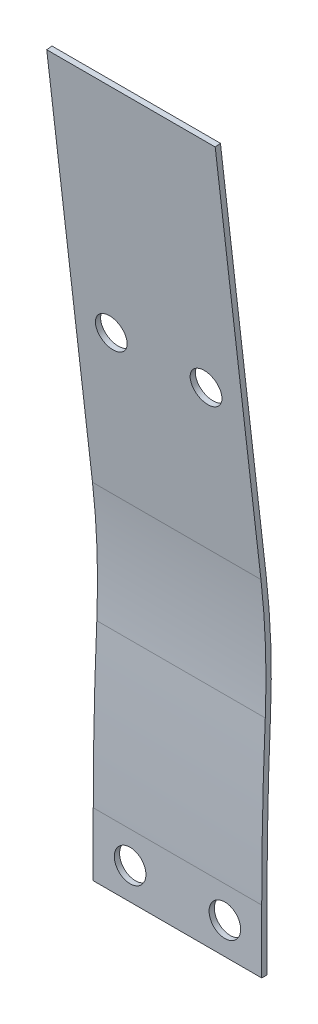
ISO-10303-21;
HEADER;
FILE_DESCRIPTION(('STEP AP214'),'2;1');
FILE_NAME('part.step','',(''),(''),'','','');
FILE_SCHEMA(('AUTOMOTIVE_DESIGN { 1 0 10303 214 1 1 1 1 }'));
ENDSEC;
DATA;
#1=APPLICATION_CONTEXT('core data for automotive mechanical design processes');
#2=APPLICATION_PROTOCOL_DEFINITION('international standard','automotive_design',2000,#1);
#3=PRODUCT_CONTEXT('',#1,'mechanical');
#4=PRODUCT('Part','Part','',(#3));
#5=PRODUCT_RELATED_PRODUCT_CATEGORY('part','',(#4));
#6=PRODUCT_DEFINITION_FORMATION('','',#4);
#7=PRODUCT_DEFINITION_CONTEXT('part definition',#1,'design');
#8=PRODUCT_DEFINITION('design','',#6,#7);
#9=PRODUCT_DEFINITION_SHAPE('','',#8);
#10=(LENGTH_UNIT() NAMED_UNIT(*) SI_UNIT(.MILLI.,.METRE.));
#11=(NAMED_UNIT(*) PLANE_ANGLE_UNIT() SI_UNIT($,.RADIAN.));
#12=(NAMED_UNIT(*) SI_UNIT($,.STERADIAN.) SOLID_ANGLE_UNIT());
#13=UNCERTAINTY_MEASURE_WITH_UNIT(LENGTH_MEASURE(1.E-05),#10,'distance_accuracy_value','');
#14=(GEOMETRIC_REPRESENTATION_CONTEXT(3) GLOBAL_UNCERTAINTY_ASSIGNED_CONTEXT((#13)) GLOBAL_UNIT_ASSIGNED_CONTEXT((#10,
#11,#12)) REPRESENTATION_CONTEXT('',''));
#15=CARTESIAN_POINT('',(0.,0.,0.));
#16=DIRECTION('',(0.,0.,1.));
#17=DIRECTION('',(1.,0.,0.));
#18=AXIS2_PLACEMENT_3D('',#15,#16,#17);
#19=CARTESIAN_POINT('',(0.,0.,0.5));
#20=DIRECTION('',(0.,0.,1.));
#21=DIRECTION('',(1.,0.,0.));
#22=AXIS2_PLACEMENT_3D('',#19,#20,#21);
#23=PLANE('',#22);
#24=CARTESIAN_POINT('',(-4.5,0.,0.5));
#25=DIRECTION('',(0.,0.,1.));
#26=DIRECTION('',(1.,0.,0.));
#27=AXIS2_PLACEMENT_3D('',#24,#25,#26);
#28=CIRCLE('',#27,1.5);
#29=CARTESIAN_POINT('',(-3.,0.,0.5));
#30=VERTEX_POINT('',#29);
#31=EDGE_CURVE('E207',#30,#30,#28,.T.);
#32=ORIENTED_EDGE('',*,*,#31,.F.);
#33=EDGE_LOOP('',(#32));
#34=FACE_BOUND('',#33,.T.);
#35=DIRECTION('',(0.,-1.,0.));
#36=VECTOR('',#35,1.);
#37=CARTESIAN_POINT('',(-8.,3.,0.5));
#38=LINE('',#37,#36);
#39=CARTESIAN_POINT('',(-8.,3.,0.5));
#40=VERTEX_POINT('',#39);
#41=CARTESIAN_POINT('',(-8.,-3.,0.5));
#42=VERTEX_POINT('',#41);
#43=EDGE_CURVE('E212',#40,#42,#38,.T.);
#44=ORIENTED_EDGE('',*,*,#43,.T.);
#45=DIRECTION('',(1.,0.,0.));
#46=VECTOR('',#45,1.);
#47=CARTESIAN_POINT('',(-8.,-3.,0.5));
#48=LINE('',#47,#46);
#49=CARTESIAN_POINT('',(8.,-3.,0.5));
#50=VERTEX_POINT('',#49);
#51=EDGE_CURVE('E84',#42,#50,#48,.T.);
#52=ORIENTED_EDGE('',*,*,#51,.T.);
#53=DIRECTION('',(0.,1.,0.));
#54=VECTOR('',#53,1.);
#55=CARTESIAN_POINT('',(8.,3.,0.5));
#56=LINE('',#55,#54);
#57=CARTESIAN_POINT('',(8.,3.,0.5));
#58=VERTEX_POINT('',#57);
#59=EDGE_CURVE('E216',#50,#58,#56,.T.);
#60=ORIENTED_EDGE('',*,*,#59,.T.);
#61=DIRECTION('',(-1.,0.,0.));
#62=VECTOR('',#61,1.);
#63=CARTESIAN_POINT('',(-8.,3.,0.5));
#64=LINE('',#63,#62);
#65=EDGE_CURVE('E59',#58,#40,#64,.T.);
#66=ORIENTED_EDGE('',*,*,#65,.T.);
#67=EDGE_LOOP('',(#44,#52,#60,#66));
#68=FACE_BOUND('',#67,.T.);
#69=CARTESIAN_POINT('',(4.5,0.,0.5));
#70=DIRECTION('',(0.,0.,1.));
#71=DIRECTION('',(1.,0.,0.));
#72=AXIS2_PLACEMENT_3D('',#69,#70,#71);
#73=CIRCLE('',#72,1.5);
#74=CARTESIAN_POINT('',(6.,0.,0.5));
#75=VERTEX_POINT('',#74);
#76=EDGE_CURVE('E201',#75,#75,#73,.T.);
#77=ORIENTED_EDGE('',*,*,#76,.F.);
#78=EDGE_LOOP('',(#77));
#79=FACE_BOUND('',#78,.T.);
#80=ADVANCED_FACE('F42',(#34,#68,#79),#23,.T.);
#81=CARTESIAN_POINT('',(0.,0.,0.));
#82=DIRECTION('',(0.,0.,1.));
#83=DIRECTION('',(1.,0.,0.));
#84=AXIS2_PLACEMENT_3D('',#81,#82,#83);
#85=PLANE('',#84);
#86=DIRECTION('',(0.,-1.,0.));
#87=VECTOR('',#86,1.);
#88=CARTESIAN_POINT('',(-8.,3.,0.));
#89=LINE('',#88,#87);
#90=CARTESIAN_POINT('',(-8.,3.,0.));
#91=VERTEX_POINT('',#90);
#92=CARTESIAN_POINT('',(-8.,-3.,0.));
#93=VERTEX_POINT('',#92);
#94=EDGE_CURVE('E79',#91,#93,#89,.T.);
#95=ORIENTED_EDGE('',*,*,#94,.F.);
#96=DIRECTION('',(-1.,0.,0.));
#97=VECTOR('',#96,1.);
#98=CARTESIAN_POINT('',(-8.,3.,0.));
#99=LINE('',#98,#97);
#100=CARTESIAN_POINT('',(8.,3.,0.));
#101=VERTEX_POINT('',#100);
#102=EDGE_CURVE('E214',#101,#91,#99,.T.);
#103=ORIENTED_EDGE('',*,*,#102,.F.);
#104=DIRECTION('',(0.,1.,0.));
#105=VECTOR('',#104,1.);
#106=CARTESIAN_POINT('',(8.,3.,0.));
#107=LINE('',#106,#105);
#108=CARTESIAN_POINT('',(8.,-3.,0.));
#109=VERTEX_POINT('',#108);
#110=EDGE_CURVE('E221',#109,#101,#107,.T.);
#111=ORIENTED_EDGE('',*,*,#110,.F.);
#112=DIRECTION('',(1.,0.,0.));
#113=VECTOR('',#112,1.);
#114=CARTESIAN_POINT('',(-8.,-3.,0.));
#115=LINE('',#114,#113);
#116=EDGE_CURVE('E72',#93,#109,#115,.T.);
#117=ORIENTED_EDGE('',*,*,#116,.F.);
#118=EDGE_LOOP('',(#95,#103,#111,#117));
#119=FACE_BOUND('',#118,.T.);
#120=CARTESIAN_POINT('',(-4.5,0.,0.));
#121=DIRECTION('',(0.,0.,1.));
#122=DIRECTION('',(1.,0.,0.));
#123=AXIS2_PLACEMENT_3D('',#120,#121,#122);
#124=CIRCLE('',#123,1.5);
#125=CARTESIAN_POINT('',(-3.,0.,0.));
#126=VERTEX_POINT('',#125);
#127=EDGE_CURVE('E204',#126,#126,#124,.T.);
#128=ORIENTED_EDGE('',*,*,#127,.T.);
#129=EDGE_LOOP('',(#128));
#130=FACE_BOUND('',#129,.T.);
#131=CARTESIAN_POINT('',(4.5,0.,0.));
#132=DIRECTION('',(0.,0.,1.));
#133=DIRECTION('',(1.,0.,0.));
#134=AXIS2_PLACEMENT_3D('',#131,#132,#133);
#135=CIRCLE('',#134,1.5);
#136=CARTESIAN_POINT('',(6.,0.,0.));
#137=VERTEX_POINT('',#136);
#138=EDGE_CURVE('E176',#137,#137,#135,.T.);
#139=ORIENTED_EDGE('',*,*,#138,.T.);
#140=EDGE_LOOP('',(#139));
#141=FACE_BOUND('',#140,.T.);
#142=ADVANCED_FACE('F227',(#119,#130,#141),#85,.F.);
#143=CARTESIAN_POINT('',(-8.,3.,0.5));
#144=DIRECTION('',(1.,0.,0.));
#145=DIRECTION('',(0.,0.,-1.));
#146=AXIS2_PLACEMENT_3D('',#143,#144,#145);
#147=PLANE('',#146);
#148=ORIENTED_EDGE('',*,*,#94,.T.);
#149=DIRECTION('',(0.,0.,-1.));
#150=VECTOR('',#149,1.);
#151=CARTESIAN_POINT('',(-8.,-3.,0.5));
#152=LINE('',#151,#150);
#153=EDGE_CURVE('E11',#42,#93,#152,.T.);
#154=ORIENTED_EDGE('',*,*,#153,.F.);
#155=ORIENTED_EDGE('',*,*,#43,.F.);
#156=CARTESIAN_POINT('',(-8.,3.,-344.390167475055));
#157=DIRECTION('',(-1.,0.,0.));
#158=DIRECTION('',(0.,0.,1.));
#159=AXIS2_PLACEMENT_3D('',#156,#157,#158);
#160=CIRCLE('',#159,344.890167475055);
#161=CARTESIAN_POINT('',(-8.,18.2202314265775,0.163996882732109));
#162=VERTEX_POINT('',#161);
#163=EDGE_CURVE('E167',#162,#40,#160,.F.);
#164=ORIENTED_EDGE('',*,*,#163,.F.);
#165=CARTESIAN_POINT('',(-8.,21.4467131980166,73.2047870925716));
#166=DIRECTION('',(-1.,0.,0.));
#167=DIRECTION('',(0.,0.,1.));
#168=AXIS2_PLACEMENT_3D('',#165,#166,#167);
#169=CIRCLE('',#168,73.1120182945268);
#170=CARTESIAN_POINT('',(-8.,29.8072386789439,0.572364354637419));
#171=VERTEX_POINT('',#170);
#172=EDGE_CURVE('E179',#171,#162,#169,.T.);
#173=ORIENTED_EDGE('',*,*,#172,.F.);
#174=DIRECTION('',(0.,0.993440263751706,0.11435227307291));
#175=VECTOR('',#174,1.);
#176=CARTESIAN_POINT('',(-8.,0.324750815805507,-2.82128660356148));
#177=LINE('',#176,#175);
#178=CARTESIAN_POINT('',(-8.,67.5579687015087,4.91775073140799));
#179=VERTEX_POINT('',#178);
#180=EDGE_CURVE('E182',#171,#179,#177,.T.);
#181=ORIENTED_EDGE('',*,*,#180,.T.);
#182=DIRECTION('',(0.,0.11435227307291,-0.993440263751706));
#183=VECTOR('',#182,1.);
#184=CARTESIAN_POINT('',(-8.,65.5123730537276,22.6889504220811));
#185=LINE('',#184,#183);
#186=CARTESIAN_POINT('',(-8.,67.6151448380452,4.42103059953213));
#187=VERTEX_POINT('',#186);
#188=EDGE_CURVE('E151',#179,#187,#185,.T.);
#189=ORIENTED_EDGE('',*,*,#188,.T.);
#190=DIRECTION('',(0.,0.993440263751706,0.11435227307291));
#191=VECTOR('',#190,1.);
#192=CARTESIAN_POINT('',(-8.,0.381926952341963,-3.31800673543734));
#193=LINE('',#192,#191);
#194=CARTESIAN_POINT('',(-8.,29.8644148154804,0.0756442227615658));
#195=VERTEX_POINT('',#194);
#196=EDGE_CURVE('E149',#195,#187,#193,.T.);
#197=ORIENTED_EDGE('',*,*,#196,.F.);
#198=CARTESIAN_POINT('',(-8.,21.4467131980166,73.2047870925716));
#199=DIRECTION('',(-1.,0.,0.));
#200=DIRECTION('',(0.,0.,1.));
#201=AXIS2_PLACEMENT_3D('',#198,#199,#200);
#202=CIRCLE('',#201,73.6120182945268);
#203=CARTESIAN_POINT('',(-8.,18.1981660955505,-0.335516001152447));
#204=VERTEX_POINT('',#203);
#205=EDGE_CURVE('E185',#195,#204,#202,.T.);
#206=ORIENTED_EDGE('',*,*,#205,.T.);
#207=CARTESIAN_POINT('',(-8.,3.,-344.390167475055));
#208=DIRECTION('',(-1.,0.,0.));
#209=DIRECTION('',(0.,0.,1.));
#210=AXIS2_PLACEMENT_3D('',#207,#208,#209);
#211=CIRCLE('',#210,344.390167475055);
#212=EDGE_CURVE('E188',#204,#91,#211,.F.);
#213=ORIENTED_EDGE('',*,*,#212,.T.);
#214=EDGE_LOOP('',(#148,#154,#155,#164,#173,#181,#189,#197,#206,#213));
#215=FACE_BOUND('',#214,.T.);
#216=ADVANCED_FACE('F44',(#215),#147,.F.);
#217=CARTESIAN_POINT('',(-8.,-3.,0.5));
#218=DIRECTION('',(0.,1.,0.));
#219=DIRECTION('',(-1.,0.,0.));
#220=AXIS2_PLACEMENT_3D('',#217,#218,#219);
#221=PLANE('',#220);
#222=ORIENTED_EDGE('',*,*,#116,.T.);
#223=DIRECTION('',(0.,0.,-1.));
#224=VECTOR('',#223,1.);
#225=CARTESIAN_POINT('',(8.,-3.,0.5));
#226=LINE('',#225,#224);
#227=EDGE_CURVE('E51',#50,#109,#226,.T.);
#228=ORIENTED_EDGE('',*,*,#227,.F.);
#229=ORIENTED_EDGE('',*,*,#51,.F.);
#230=ORIENTED_EDGE('',*,*,#153,.T.);
#231=EDGE_LOOP('',(#222,#228,#229,#230));
#232=FACE_BOUND('',#231,.T.);
#233=ADVANCED_FACE('F262',(#232),#221,.F.);
#234=CARTESIAN_POINT('',(8.,3.,0.5));
#235=DIRECTION('',(-1.,0.,0.));
#236=DIRECTION('',(0.,0.,1.));
#237=AXIS2_PLACEMENT_3D('',#234,#235,#236);
#238=PLANE('',#237);
#239=ORIENTED_EDGE('',*,*,#110,.T.);
#240=CARTESIAN_POINT('',(8.,3.,-344.390167475055));
#241=DIRECTION('',(-1.,0.,0.));
#242=DIRECTION('',(0.,0.,1.));
#243=AXIS2_PLACEMENT_3D('',#240,#241,#242);
#244=CIRCLE('',#243,344.390167475055);
#245=CARTESIAN_POINT('',(8.,18.1981660955505,-0.335516001152447));
#246=VERTEX_POINT('',#245);
#247=EDGE_CURVE('E171',#101,#246,#244,.T.);
#248=ORIENTED_EDGE('',*,*,#247,.T.);
#249=CARTESIAN_POINT('',(8.,21.4467131980166,73.2047870925716));
#250=DIRECTION('',(-1.,0.,0.));
#251=DIRECTION('',(0.,0.,1.));
#252=AXIS2_PLACEMENT_3D('',#249,#250,#251);
#253=CIRCLE('',#252,73.6120182945268);
#254=CARTESIAN_POINT('',(8.,29.8644148154803,0.0756442227615615));
#255=VERTEX_POINT('',#254);
#256=EDGE_CURVE('E132',#246,#255,#253,.F.);
#257=ORIENTED_EDGE('',*,*,#256,.T.);
#258=DIRECTION('',(0.,-0.993440263751706,-0.11435227307291));
#259=VECTOR('',#258,1.);
#260=CARTESIAN_POINT('',(8.,0.381926952341963,-3.31800673543734));
#261=LINE('',#260,#259);
#262=CARTESIAN_POINT('',(8.,67.6151448380452,4.42103059953213));
#263=VERTEX_POINT('',#262);
#264=EDGE_CURVE('E125',#263,#255,#261,.T.);
#265=ORIENTED_EDGE('',*,*,#264,.F.);
#266=DIRECTION('',(0.,0.11435227307291,-0.993440263751706));
#267=VECTOR('',#266,1.);
#268=CARTESIAN_POINT('',(8.,65.5123730537276,22.6889504220811));
#269=LINE('',#268,#267);
#270=CARTESIAN_POINT('',(8.,67.5579687015087,4.91775073140799));
#271=VERTEX_POINT('',#270);
#272=EDGE_CURVE('E129',#271,#263,#269,.T.);
#273=ORIENTED_EDGE('',*,*,#272,.F.);
#274=DIRECTION('',(0.,-0.993440263751706,-0.11435227307291));
#275=VECTOR('',#274,1.);
#276=CARTESIAN_POINT('',(8.,0.324750815805507,-2.82128660356148));
#277=LINE('',#276,#275);
#278=CARTESIAN_POINT('',(8.,29.8072386789439,0.572364354637419));
#279=VERTEX_POINT('',#278);
#280=EDGE_CURVE('E136',#271,#279,#277,.T.);
#281=ORIENTED_EDGE('',*,*,#280,.T.);
#282=CARTESIAN_POINT('',(8.,21.4467131980166,73.2047870925716));
#283=DIRECTION('',(-1.,0.,0.));
#284=DIRECTION('',(0.,0.,1.));
#285=AXIS2_PLACEMENT_3D('',#282,#283,#284);
#286=CIRCLE('',#285,73.1120182945268);
#287=CARTESIAN_POINT('',(8.,18.2202314265775,0.163996882732109));
#288=VERTEX_POINT('',#287);
#289=EDGE_CURVE('E168',#288,#279,#286,.F.);
#290=ORIENTED_EDGE('',*,*,#289,.F.);
#291=CARTESIAN_POINT('',(8.,3.,-344.390167475055));
#292=DIRECTION('',(-1.,0.,0.));
#293=DIRECTION('',(0.,0.,1.));
#294=AXIS2_PLACEMENT_3D('',#291,#292,#293);
#295=CIRCLE('',#294,344.890167475055);
#296=EDGE_CURVE('E173',#58,#288,#295,.T.);
#297=ORIENTED_EDGE('',*,*,#296,.F.);
#298=ORIENTED_EDGE('',*,*,#59,.F.);
#299=ORIENTED_EDGE('',*,*,#227,.T.);
#300=EDGE_LOOP('',(#239,#248,#257,#265,#273,#281,#290,#297,#298,#299));
#301=FACE_BOUND('',#300,.T.);
#302=ADVANCED_FACE('F128',(#301),#238,.F.);
#303=CARTESIAN_POINT('',(-4.5,0.,0.5));
#304=DIRECTION('',(0.,0.,-1.));
#305=DIRECTION('',(-1.,0.,0.));
#306=AXIS2_PLACEMENT_3D('',#303,#304,#305);
#307=CYLINDRICAL_SURFACE('',#306,1.5);
#308=ORIENTED_EDGE('',*,*,#31,.T.);
#309=EDGE_LOOP('',(#308));
#310=FACE_BOUND('',#309,.T.);
#311=ORIENTED_EDGE('',*,*,#127,.F.);
#312=EDGE_LOOP('',(#311));
#313=FACE_BOUND('',#312,.T.);
#314=ADVANCED_FACE('F258',(#310,#313),#307,.F.);
#315=CARTESIAN_POINT('',(4.5,0.,0.5));
#316=DIRECTION('',(0.,0.,-1.));
#317=DIRECTION('',(-1.,0.,0.));
#318=AXIS2_PLACEMENT_3D('',#315,#316,#317);
#319=CYLINDRICAL_SURFACE('',#318,1.5);
#320=ORIENTED_EDGE('',*,*,#76,.T.);
#321=EDGE_LOOP('',(#320));
#322=FACE_BOUND('',#321,.T.);
#323=ORIENTED_EDGE('',*,*,#138,.F.);
#324=EDGE_LOOP('',(#323));
#325=FACE_BOUND('',#324,.T.);
#326=ADVANCED_FACE('F289',(#322,#325),#319,.F.);
#327=CARTESIAN_POINT('',(64.8389743920276,21.4467131980166,73.2047870925716));
#328=DIRECTION('',(-1.,0.,0.));
#329=DIRECTION('',(0.,0.,1.));
#330=AXIS2_PLACEMENT_3D('',#327,#328,#329);
#331=CYLINDRICAL_SURFACE('',#330,73.1120182945268);
#332=DIRECTION('',(-1.,0.,0.));
#333=VECTOR('',#332,1.);
#334=CARTESIAN_POINT('',(64.8389743920276,18.2202314265775,0.163996882732109));
#335=LINE('',#334,#333);
#336=EDGE_CURVE('E191',#288,#162,#335,.T.);
#337=ORIENTED_EDGE('',*,*,#336,.F.);
#338=ORIENTED_EDGE('',*,*,#289,.T.);
#339=DIRECTION('',(-1.,0.,0.));
#340=VECTOR('',#339,1.);
#341=CARTESIAN_POINT('',(64.8389743920276,29.8072386789439,0.572364354637419));
#342=LINE('',#341,#340);
#343=EDGE_CURVE('E196',#279,#171,#342,.T.);
#344=ORIENTED_EDGE('',*,*,#343,.T.);
#345=ORIENTED_EDGE('',*,*,#172,.T.);
#346=EDGE_LOOP('',(#337,#338,#344,#345));
#347=FACE_BOUND('',#346,.T.);
#348=ADVANCED_FACE('F285',(#347),#331,.F.);
#349=CARTESIAN_POINT('',(64.8389743920276,0.324750815805507,-2.82128660356148));
#350=DIRECTION('',(0.,-0.11435227307291,0.993440263751706));
#351=DIRECTION('',(0.,-0.993440263751706,-0.11435227307291));
#352=AXIS2_PLACEMENT_3D('',#349,#350,#351);
#353=PLANE('',#352);
#354=CARTESIAN_POINT('',(4.5,44.7088426352195,2.28764845073107));
#355=DIRECTION('',(0.,-0.11435227307291,0.993440263751706));
#356=DIRECTION('',(0.,-0.993440263751706,-0.11435227307291));
#357=AXIS2_PLACEMENT_3D('',#354,#355,#356);
#358=CIRCLE('',#357,1.5);
#359=CARTESIAN_POINT('',(4.5,43.2186822395919,2.1161200411217));
#360=VERTEX_POINT('',#359);
#361=EDGE_CURVE('E164',#360,#360,#358,.T.);
#362=ORIENTED_EDGE('',*,*,#361,.F.);
#363=EDGE_LOOP('',(#362));
#364=FACE_BOUND('',#363,.T.);
#365=CARTESIAN_POINT('',(-4.5,44.7088426352195,2.28764845073107));
#366=DIRECTION('',(0.,-0.11435227307291,0.993440263751706));
#367=DIRECTION('',(0.,-0.993440263751706,-0.11435227307291));
#368=AXIS2_PLACEMENT_3D('',#365,#366,#367);
#369=CIRCLE('',#368,1.5);
#370=CARTESIAN_POINT('',(-4.5,43.2186822395919,2.1161200411217));
#371=VERTEX_POINT('',#370);
#372=EDGE_CURVE('E159',#371,#371,#369,.T.);
#373=ORIENTED_EDGE('',*,*,#372,.F.);
#374=EDGE_LOOP('',(#373));
#375=FACE_BOUND('',#374,.T.);
#376=ORIENTED_EDGE('',*,*,#280,.F.);
#377=DIRECTION('',(1.,0.,0.));
#378=VECTOR('',#377,1.);
#379=CARTESIAN_POINT('',(8.,67.5579687015087,4.91775073140799));
#380=LINE('',#379,#378);
#381=EDGE_CURVE('E144',#179,#271,#380,.T.);
#382=ORIENTED_EDGE('',*,*,#381,.F.);
#383=ORIENTED_EDGE('',*,*,#180,.F.);
#384=ORIENTED_EDGE('',*,*,#343,.F.);
#385=EDGE_LOOP('',(#376,#382,#383,#384));
#386=FACE_BOUND('',#385,.T.);
#387=ADVANCED_FACE('F246',(#364,#375,#386),#353,.T.);
#388=CARTESIAN_POINT('',(64.8389743920276,0.381926952341963,-3.31800673543734));
#389=DIRECTION('',(0.,-0.11435227307291,0.993440263751706));
#390=DIRECTION('',(0.,-0.993440263751706,-0.11435227307291));
#391=AXIS2_PLACEMENT_3D('',#388,#389,#390);
#392=PLANE('',#391);
#393=CARTESIAN_POINT('',(4.5,44.7660187717559,1.79092831885521));
#394=DIRECTION('',(0.,0.11435227307291,-0.993440263751706));
#395=DIRECTION('',(0.,0.993440263751706,0.11435227307291));
#396=AXIS2_PLACEMENT_3D('',#393,#394,#395);
#397=CIRCLE('',#396,1.5);
#398=CARTESIAN_POINT('',(4.5,46.2561791673835,1.96245672846457));
#399=VERTEX_POINT('',#398);
#400=EDGE_CURVE('E156',#399,#399,#397,.T.);
#401=ORIENTED_EDGE('',*,*,#400,.F.);
#402=EDGE_LOOP('',(#401));
#403=FACE_BOUND('',#402,.T.);
#404=CARTESIAN_POINT('',(-4.5,44.7660187717559,1.79092831885521));
#405=DIRECTION('',(0.,0.11435227307291,-0.993440263751706));
#406=DIRECTION('',(0.,0.993440263751706,0.11435227307291));
#407=AXIS2_PLACEMENT_3D('',#404,#405,#406);
#408=CIRCLE('',#407,1.5);
#409=CARTESIAN_POINT('',(-4.5,46.2561791673835,1.96245672846457));
#410=VERTEX_POINT('',#409);
#411=EDGE_CURVE('E145',#410,#410,#408,.T.);
#412=ORIENTED_EDGE('',*,*,#411,.F.);
#413=EDGE_LOOP('',(#412));
#414=FACE_BOUND('',#413,.T.);
#415=ORIENTED_EDGE('',*,*,#196,.T.);
#416=DIRECTION('',(1.,0.,0.));
#417=VECTOR('',#416,1.);
#418=CARTESIAN_POINT('',(8.,67.6151448380452,4.42103059953213));
#419=LINE('',#418,#417);
#420=EDGE_CURVE('E142',#187,#263,#419,.T.);
#421=ORIENTED_EDGE('',*,*,#420,.T.);
#422=ORIENTED_EDGE('',*,*,#264,.T.);
#423=DIRECTION('',(-1.,0.,0.));
#424=VECTOR('',#423,1.);
#425=CARTESIAN_POINT('',(64.8389743920276,29.8644148154804,0.0756442227615658));
#426=LINE('',#425,#424);
#427=EDGE_CURVE('E194',#255,#195,#426,.T.);
#428=ORIENTED_EDGE('',*,*,#427,.T.);
#429=EDGE_LOOP('',(#415,#421,#422,#428));
#430=FACE_BOUND('',#429,.T.);
#431=ADVANCED_FACE('F147',(#403,#414,#430),#392,.F.);
#432=CARTESIAN_POINT('',(64.8389743920276,21.4467131980166,73.2047870925716));
#433=DIRECTION('',(-1.,0.,0.));
#434=DIRECTION('',(0.,0.,1.));
#435=AXIS2_PLACEMENT_3D('',#432,#433,#434);
#436=CYLINDRICAL_SURFACE('',#435,73.6120182945268);
#437=ORIENTED_EDGE('',*,*,#256,.F.);
#438=DIRECTION('',(-1.,0.,0.));
#439=VECTOR('',#438,1.);
#440=CARTESIAN_POINT('',(64.8389743920276,18.1981660955505,-0.335516001152447));
#441=LINE('',#440,#439);
#442=EDGE_CURVE('E192',#246,#204,#441,.T.);
#443=ORIENTED_EDGE('',*,*,#442,.T.);
#444=ORIENTED_EDGE('',*,*,#205,.F.);
#445=ORIENTED_EDGE('',*,*,#427,.F.);
#446=EDGE_LOOP('',(#437,#443,#444,#445));
#447=FACE_BOUND('',#446,.T.);
#448=ADVANCED_FACE('F237',(#447),#436,.T.);
#449=CARTESIAN_POINT('',(64.8389743920276,3.,-344.390167475055));
#450=DIRECTION('',(-1.,0.,0.));
#451=DIRECTION('',(0.,0.,1.));
#452=AXIS2_PLACEMENT_3D('',#449,#450,#451);
#453=CYLINDRICAL_SURFACE('',#452,344.390167475055);
#454=ORIENTED_EDGE('',*,*,#247,.F.);
#455=ORIENTED_EDGE('',*,*,#102,.T.);
#456=ORIENTED_EDGE('',*,*,#212,.F.);
#457=ORIENTED_EDGE('',*,*,#442,.F.);
#458=EDGE_LOOP('',(#454,#455,#456,#457));
#459=FACE_BOUND('',#458,.T.);
#460=ADVANCED_FACE('F231',(#459),#453,.F.);
#461=CARTESIAN_POINT('',(64.8389743920276,3.,-344.390167475055));
#462=DIRECTION('',(-1.,0.,0.));
#463=DIRECTION('',(0.,0.,1.));
#464=AXIS2_PLACEMENT_3D('',#461,#462,#463);
#465=CYLINDRICAL_SURFACE('',#464,344.890167475055);
#466=ORIENTED_EDGE('',*,*,#65,.F.);
#467=ORIENTED_EDGE('',*,*,#296,.T.);
#468=ORIENTED_EDGE('',*,*,#336,.T.);
#469=ORIENTED_EDGE('',*,*,#163,.T.);
#470=EDGE_LOOP('',(#466,#467,#468,#469));
#471=FACE_BOUND('',#470,.T.);
#472=ADVANCED_FACE('F244',(#471),#465,.T.);
#473=CARTESIAN_POINT('',(-4.5,43.8901207394235,9.40032994137646));
#474=DIRECTION('',(0.,0.11435227307291,-0.993440263751706));
#475=DIRECTION('',(0.,0.993440263751706,0.11435227307291));
#476=AXIS2_PLACEMENT_3D('',#473,#474,#475);
#477=CYLINDRICAL_SURFACE('',#476,1.5);
#478=ORIENTED_EDGE('',*,*,#372,.T.);
#479=EDGE_LOOP('',(#478));
#480=FACE_BOUND('',#479,.T.);
#481=ORIENTED_EDGE('',*,*,#411,.T.);
#482=EDGE_LOOP('',(#481));
#483=FACE_BOUND('',#482,.T.);
#484=ADVANCED_FACE('F318',(#480,#483),#477,.F.);
#485=CARTESIAN_POINT('',(4.5,43.8901207394235,9.40032994137646));
#486=DIRECTION('',(0.,0.11435227307291,-0.993440263751706));
#487=DIRECTION('',(0.,0.993440263751706,0.11435227307291));
#488=AXIS2_PLACEMENT_3D('',#485,#486,#487);
#489=CYLINDRICAL_SURFACE('',#488,1.5);
#490=ORIENTED_EDGE('',*,*,#361,.T.);
#491=EDGE_LOOP('',(#490));
#492=FACE_BOUND('',#491,.T.);
#493=ORIENTED_EDGE('',*,*,#400,.T.);
#494=EDGE_LOOP('',(#493));
#495=FACE_BOUND('',#494,.T.);
#496=ADVANCED_FACE('F328',(#492,#495),#489,.F.);
#497=CARTESIAN_POINT('',(8.,65.5123730537276,22.6889504220811));
#498=DIRECTION('',(0.,0.993440263751706,0.11435227307291));
#499=DIRECTION('',(0.,-0.11435227307291,0.993440263751706));
#500=AXIS2_PLACEMENT_3D('',#497,#498,#499);
#501=PLANE('',#500);
#502=ORIENTED_EDGE('',*,*,#188,.F.);
#503=ORIENTED_EDGE('',*,*,#381,.T.);
#504=ORIENTED_EDGE('',*,*,#272,.T.);
#505=ORIENTED_EDGE('',*,*,#420,.F.);
#506=EDGE_LOOP('',(#502,#503,#504,#505));
#507=FACE_BOUND('',#506,.T.);
#508=ADVANCED_FACE('F141',(#507),#501,.T.);
#509=CLOSED_SHELL('',(#80,#142,#216,#233,#302,#314,#326,#348,#387,#431,#448,#460,#472,#484,#496,#508));
#510=MANIFOLD_SOLID_BREP('B2',#509);
#511=ADVANCED_BREP_SHAPE_REPRESENTATION('',(#18,#510),#14);
#512=SHAPE_DEFINITION_REPRESENTATION(#9,#511);
ENDSEC;
END-ISO-10303-21;
